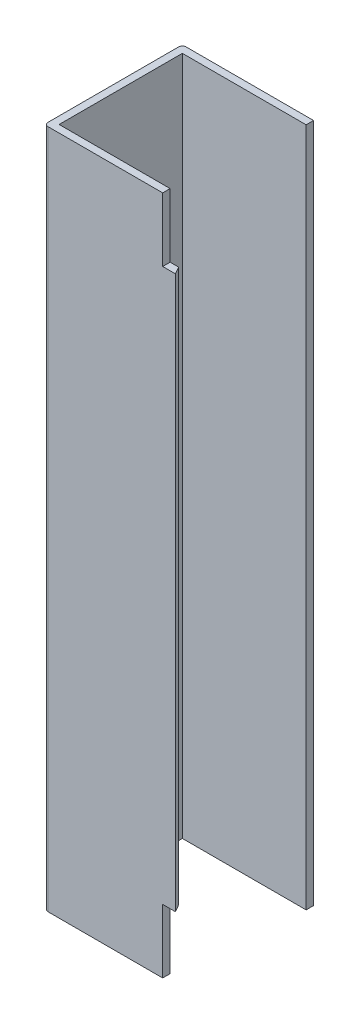
ISO-10303-21;
HEADER;
FILE_DESCRIPTION(('STEP AP214'),'2;1');
FILE_NAME('part.step','',(''),(''),'','','');
FILE_SCHEMA(('AUTOMOTIVE_DESIGN { 1 0 10303 214 1 1 1 1 }'));
ENDSEC;
DATA;
#1=APPLICATION_CONTEXT('core data for automotive mechanical design processes');
#2=APPLICATION_PROTOCOL_DEFINITION('international standard','automotive_design',2000,#1);
#3=PRODUCT_CONTEXT('',#1,'mechanical');
#4=PRODUCT('Part','Part','',(#3));
#5=PRODUCT_RELATED_PRODUCT_CATEGORY('part','',(#4));
#6=PRODUCT_DEFINITION_FORMATION('','',#4);
#7=PRODUCT_DEFINITION_CONTEXT('part definition',#1,'design');
#8=PRODUCT_DEFINITION('design','',#6,#7);
#9=PRODUCT_DEFINITION_SHAPE('','',#8);
#10=(LENGTH_UNIT() NAMED_UNIT(*) SI_UNIT(.MILLI.,.METRE.));
#11=(NAMED_UNIT(*) PLANE_ANGLE_UNIT() SI_UNIT($,.RADIAN.));
#12=(NAMED_UNIT(*) SI_UNIT($,.STERADIAN.) SOLID_ANGLE_UNIT());
#13=UNCERTAINTY_MEASURE_WITH_UNIT(LENGTH_MEASURE(1.E-05),#10,'distance_accuracy_value','');
#14=(GEOMETRIC_REPRESENTATION_CONTEXT(3) GLOBAL_UNCERTAINTY_ASSIGNED_CONTEXT((#13)) GLOBAL_UNIT_ASSIGNED_CONTEXT((#10,
#11,#12)) REPRESENTATION_CONTEXT('',''));
#15=CARTESIAN_POINT('',(0.,0.,0.));
#16=DIRECTION('',(0.,0.,1.));
#17=DIRECTION('',(1.,0.,0.));
#18=AXIS2_PLACEMENT_3D('',#15,#16,#17);
#19=CARTESIAN_POINT('',(-3.115,-1.6,0.0175));
#20=DIRECTION('',(1.,0.,0.));
#21=DIRECTION('',(0.,1.,0.));
#22=AXIS2_PLACEMENT_3D('',#19,#20,#21);
#23=PLANE('',#22);
#24=DIRECTION('',(0.,0.,1.));
#25=VECTOR('',#24,1.);
#26=CARTESIAN_POINT('',(-3.115,1.6,0.0175));
#27=LINE('',#26,#25);
#28=CARTESIAN_POINT('',(-3.115,1.6,0.0349999999999988));
#29=VERTEX_POINT('',#28);
#30=CARTESIAN_POINT('',(-3.115,1.6,0.615));
#31=VERTEX_POINT('',#30);
#32=EDGE_CURVE('E135',#29,#31,#27,.T.);
#33=ORIENTED_EDGE('',*,*,#32,.T.);
#34=DIRECTION('',(0.,1.,0.));
#35=VECTOR('',#34,1.);
#36=CARTESIAN_POINT('',(-3.115,0.,0.615));
#37=LINE('',#36,#35);
#38=CARTESIAN_POINT('',(-3.115,-1.6,0.614999999999999));
#39=VERTEX_POINT('',#38);
#40=EDGE_CURVE('E138',#39,#31,#37,.T.);
#41=ORIENTED_EDGE('',*,*,#40,.F.);
#42=DIRECTION('',(0.,0.,1.));
#43=VECTOR('',#42,1.);
#44=CARTESIAN_POINT('',(-3.115,-1.6,0.0175));
#45=LINE('',#44,#43);
#46=CARTESIAN_POINT('',(-3.115,-1.6,0.0349999999999995));
#47=VERTEX_POINT('',#46);
#48=EDGE_CURVE('E123',#39,#47,#45,.F.);
#49=ORIENTED_EDGE('',*,*,#48,.T.);
#50=DIRECTION('',(0.,1.,0.));
#51=VECTOR('',#50,1.);
#52=CARTESIAN_POINT('',(-3.115,-1.6,0.0349999999999993));
#53=LINE('',#52,#51);
#54=EDGE_CURVE('E148',#29,#47,#53,.F.);
#55=ORIENTED_EDGE('',*,*,#54,.F.);
#56=EDGE_LOOP('',(#33,#41,#49,#55));
#57=FACE_BOUND('',#56,.T.);
#58=ADVANCED_FACE('F17',(#57),#23,.T.);
#59=CARTESIAN_POINT('',(-2.5325,-1.6,0.035));
#60=DIRECTION('',(0.,0.,1.));
#61=DIRECTION('',(1.,0.,0.));
#62=AXIS2_PLACEMENT_3D('',#59,#60,#61);
#63=PLANE('',#62);
#64=DIRECTION('',(1.,0.,0.));
#65=VECTOR('',#64,1.);
#66=CARTESIAN_POINT('',(-2.5325,1.6,0.0349999999999989));
#67=LINE('',#66,#65);
#68=CARTESIAN_POINT('',(-2.5325,1.6,0.0349999999999996));
#69=VERTEX_POINT('',#68);
#70=EDGE_CURVE('E150',#69,#29,#67,.F.);
#71=ORIENTED_EDGE('',*,*,#70,.T.);
#72=ORIENTED_EDGE('',*,*,#54,.T.);
#73=DIRECTION('',(1.,0.,0.));
#74=VECTOR('',#73,1.);
#75=CARTESIAN_POINT('',(-2.5325,-1.6,0.035));
#76=LINE('',#75,#74);
#77=CARTESIAN_POINT('',(-2.5325,-1.6,0.035));
#78=VERTEX_POINT('',#77);
#79=EDGE_CURVE('E131',#47,#78,#76,.T.);
#80=ORIENTED_EDGE('',*,*,#79,.T.);
#81=DIRECTION('',(0.,-1.,0.));
#82=VECTOR('',#81,1.);
#83=CARTESIAN_POINT('',(-2.5325,0.,0.035));
#84=LINE('',#83,#82);
#85=EDGE_CURVE('E276',#78,#69,#84,.F.);
#86=ORIENTED_EDGE('',*,*,#85,.T.);
#87=EDGE_LOOP('',(#71,#72,#80,#86));
#88=FACE_BOUND('',#87,.T.);
#89=ADVANCED_FACE('F299',(#88),#63,.T.);
#90=CARTESIAN_POINT('',(-2.828508757436,0.,0.615));
#91=DIRECTION('',(0.,0.,-1.));
#92=DIRECTION('',(0.,1.,0.));
#93=AXIS2_PLACEMENT_3D('',#90,#91,#92);
#94=PLANE('',#93);
#95=DIRECTION('',(1.,0.,0.));
#96=VECTOR('',#95,1.);
#97=CARTESIAN_POINT('',(-2.5925,-1.3,0.615));
#98=LINE('',#97,#96);
#99=CARTESIAN_POINT('',(-2.5925,-1.3,0.615));
#100=VERTEX_POINT('',#99);
#101=CARTESIAN_POINT('',(-2.55270725942012,-1.3,0.615000000000071));
#102=VERTEX_POINT('',#101);
#103=EDGE_CURVE('E268',#100,#102,#98,.T.);
#104=ORIENTED_EDGE('',*,*,#103,.F.);
#105=DIRECTION('',(0.,1.,0.));
#106=VECTOR('',#105,1.);
#107=CARTESIAN_POINT('',(-2.5925,0.,0.615));
#108=LINE('',#107,#106);
#109=CARTESIAN_POINT('',(-2.5925,-1.6,0.615));
#110=VERTEX_POINT('',#109);
#111=EDGE_CURVE('E147',#100,#110,#108,.F.);
#112=ORIENTED_EDGE('',*,*,#111,.T.);
#113=DIRECTION('',(1.,0.,0.));
#114=VECTOR('',#113,1.);
#115=CARTESIAN_POINT('',(-2.828508757436,-1.6,0.614999999999999));
#116=LINE('',#115,#114);
#117=EDGE_CURVE('E128',#110,#39,#116,.F.);
#118=ORIENTED_EDGE('',*,*,#117,.T.);
#119=ORIENTED_EDGE('',*,*,#40,.T.);
#120=DIRECTION('',(1.,0.,0.));
#121=VECTOR('',#120,1.);
#122=CARTESIAN_POINT('',(-2.828508757436,1.6,0.615000000000001));
#123=LINE('',#122,#121);
#124=CARTESIAN_POINT('',(-2.5925,1.6,0.615));
#125=VERTEX_POINT('',#124);
#126=EDGE_CURVE('E142',#31,#125,#123,.T.);
#127=ORIENTED_EDGE('',*,*,#126,.T.);
#128=DIRECTION('',(0.,1.,0.));
#129=VECTOR('',#128,1.);
#130=CARTESIAN_POINT('',(-2.5925,0.,0.615));
#131=LINE('',#130,#129);
#132=CARTESIAN_POINT('',(-2.5925,1.3,0.615));
#133=VERTEX_POINT('',#132);
#134=EDGE_CURVE('E158',#125,#133,#131,.F.);
#135=ORIENTED_EDGE('',*,*,#134,.T.);
#136=DIRECTION('',(1.,0.,0.));
#137=VECTOR('',#136,1.);
#138=CARTESIAN_POINT('',(-2.828508757436,1.3,0.615000000000001));
#139=LINE('',#138,#137);
#140=CARTESIAN_POINT('',(-2.55270725942006,1.3,0.615000000000036));
#141=VERTEX_POINT('',#140);
#142=EDGE_CURVE('E161',#133,#141,#139,.T.);
#143=ORIENTED_EDGE('',*,*,#142,.T.);
#144=DIRECTION('',(0.,1.,0.));
#145=VECTOR('',#144,1.);
#146=CARTESIAN_POINT('',(-2.55270725942019,-1.3,0.615000000000107));
#147=LINE('',#146,#145);
#148=EDGE_CURVE('E258',#141,#102,#147,.F.);
#149=ORIENTED_EDGE('',*,*,#148,.T.);
#150=EDGE_LOOP('',(#104,#112,#118,#119,#127,#135,#143,#149));
#151=FACE_BOUND('',#150,.T.);
#152=ADVANCED_FACE('F146',(#151),#94,.T.);
#153=CARTESIAN_POINT('',(-2.5325,0.,0.0175));
#154=DIRECTION('',(-1.,0.,0.));
#155=DIRECTION('',(0.,-1.,0.));
#156=AXIS2_PLACEMENT_3D('',#153,#154,#155);
#157=PLANE('',#156);
#158=DIRECTION('',(0.,1.,0.));
#159=VECTOR('',#158,1.);
#160=CARTESIAN_POINT('',(-2.5325,1.6,0.));
#161=LINE('',#160,#159);
#162=CARTESIAN_POINT('',(-2.5325,1.6,0.));
#163=VERTEX_POINT('',#162);
#164=CARTESIAN_POINT('',(-2.5325,-1.6,0.));
#165=VERTEX_POINT('',#164);
#166=EDGE_CURVE('E223',#163,#165,#161,.F.);
#167=ORIENTED_EDGE('',*,*,#166,.F.);
#168=DIRECTION('',(0.,0.,1.));
#169=VECTOR('',#168,1.);
#170=CARTESIAN_POINT('',(-2.5325,1.6,0.0175));
#171=LINE('',#170,#169);
#172=EDGE_CURVE('E274',#69,#163,#171,.F.);
#173=ORIENTED_EDGE('',*,*,#172,.F.);
#174=ORIENTED_EDGE('',*,*,#85,.F.);
#175=DIRECTION('',(0.,0.,1.));
#176=VECTOR('',#175,1.);
#177=CARTESIAN_POINT('',(-2.5325,-1.6,0.0175));
#178=LINE('',#177,#176);
#179=EDGE_CURVE('E271',#165,#78,#178,.T.);
#180=ORIENTED_EDGE('',*,*,#179,.F.);
#181=EDGE_LOOP('',(#167,#173,#174,#180));
#182=FACE_BOUND('',#181,.T.);
#183=ADVANCED_FACE('F335',(#182),#157,.F.);
#184=CARTESIAN_POINT('',(-2.5925,-1.3,0.615));
#185=DIRECTION('',(0.,-1.,0.));
#186=DIRECTION('',(0.,0.,-1.));
#187=AXIS2_PLACEMENT_3D('',#184,#185,#186);
#188=PLANE('',#187);
#189=DIRECTION('',(0.499999999974195,0.,0.866025403799337));
#190=VECTOR('',#189,1.);
#191=CARTESIAN_POINT('',(-2.5325,-1.3,0.65));
#192=LINE('',#191,#190);
#193=CARTESIAN_POINT('',(-2.5325,-1.3,0.65));
#194=VERTEX_POINT('',#193);
#195=EDGE_CURVE('E250',#102,#194,#192,.T.);
#196=ORIENTED_EDGE('',*,*,#195,.T.);
#197=DIRECTION('',(1.,0.,0.));
#198=VECTOR('',#197,1.);
#199=CARTESIAN_POINT('',(-2.837236842105,-1.3,0.65));
#200=LINE('',#199,#198);
#201=CARTESIAN_POINT('',(-2.5925,-1.3,0.65));
#202=VERTEX_POINT('',#201);
#203=EDGE_CURVE('E215',#202,#194,#200,.T.);
#204=ORIENTED_EDGE('',*,*,#203,.F.);
#205=DIRECTION('',(0.,0.,1.));
#206=VECTOR('',#205,1.);
#207=CARTESIAN_POINT('',(-2.5925,-1.3,0.6325));
#208=LINE('',#207,#206);
#209=EDGE_CURVE('E216',#100,#202,#208,.T.);
#210=ORIENTED_EDGE('',*,*,#209,.F.);
#211=ORIENTED_EDGE('',*,*,#103,.T.);
#212=EDGE_LOOP('',(#196,#204,#210,#211));
#213=FACE_BOUND('',#212,.T.);
#214=ADVANCED_FACE('F317',(#213),#188,.T.);
#215=CARTESIAN_POINT('',(-2.5325,-1.3,0.65));
#216=DIRECTION('',(-0.866025403799337,0.,0.499999999974195));
#217=DIRECTION('',(0.499999999974195,0.,0.866025403799337));
#218=AXIS2_PLACEMENT_3D('',#215,#216,#217);
#219=PLANE('',#218);
#220=ORIENTED_EDGE('',*,*,#148,.F.);
#221=DIRECTION('',(-0.499999999969617,0.,-0.86602540380198));
#222=VECTOR('',#221,1.);
#223=CARTESIAN_POINT('',(-2.5325,1.3,0.65));
#224=LINE('',#223,#222);
#225=CARTESIAN_POINT('',(-2.5325,1.3,0.650000000000001));
#226=VERTEX_POINT('',#225);
#227=EDGE_CURVE('E241',#226,#141,#224,.T.);
#228=ORIENTED_EDGE('',*,*,#227,.F.);
#229=DIRECTION('',(0.,-1.,0.));
#230=VECTOR('',#229,1.);
#231=CARTESIAN_POINT('',(-2.5325,0.,0.65));
#232=LINE('',#231,#230);
#233=EDGE_CURVE('E245',#194,#226,#232,.F.);
#234=ORIENTED_EDGE('',*,*,#233,.F.);
#235=ORIENTED_EDGE('',*,*,#195,.F.);
#236=EDGE_LOOP('',(#220,#228,#234,#235));
#237=FACE_BOUND('',#236,.T.);
#238=ADVANCED_FACE('F313',(#237),#219,.F.);
#239=CARTESIAN_POINT('',(-2.5925,1.3,0.65));
#240=DIRECTION('',(0.,1.,0.));
#241=DIRECTION('',(0.,0.,1.));
#242=AXIS2_PLACEMENT_3D('',#239,#240,#241);
#243=PLANE('',#242);
#244=ORIENTED_EDGE('',*,*,#227,.T.);
#245=ORIENTED_EDGE('',*,*,#142,.F.);
#246=DIRECTION('',(0.,0.,1.));
#247=VECTOR('',#246,1.);
#248=CARTESIAN_POINT('',(-2.5925,1.3,0.6325));
#249=LINE('',#248,#247);
#250=CARTESIAN_POINT('',(-2.5925,1.3,0.650000000000001));
#251=VERTEX_POINT('',#250);
#252=EDGE_CURVE('E236',#251,#133,#249,.F.);
#253=ORIENTED_EDGE('',*,*,#252,.F.);
#254=DIRECTION('',(1.,0.,0.));
#255=VECTOR('',#254,1.);
#256=CARTESIAN_POINT('',(-2.837236842105,1.3,0.650000000000001));
#257=LINE('',#256,#255);
#258=EDGE_CURVE('E227',#226,#251,#257,.F.);
#259=ORIENTED_EDGE('',*,*,#258,.F.);
#260=EDGE_LOOP('',(#244,#245,#253,#259));
#261=FACE_BOUND('',#260,.T.);
#262=ADVANCED_FACE('F310',(#261),#243,.T.);
#263=CARTESIAN_POINT('',(-2.5925,0.,0.6325));
#264=DIRECTION('',(1.,0.,0.));
#265=DIRECTION('',(0.,1.,0.));
#266=AXIS2_PLACEMENT_3D('',#263,#264,#265);
#267=PLANE('',#266);
#268=DIRECTION('',(0.,0.,1.));
#269=VECTOR('',#268,1.);
#270=CARTESIAN_POINT('',(-2.5925,1.6,0.314647487115));
#271=LINE('',#270,#269);
#272=CARTESIAN_POINT('',(-2.5925,1.6,0.65));
#273=VERTEX_POINT('',#272);
#274=EDGE_CURVE('E202',#273,#125,#271,.F.);
#275=ORIENTED_EDGE('',*,*,#274,.F.);
#276=DIRECTION('',(0.,-1.,0.));
#277=VECTOR('',#276,1.);
#278=CARTESIAN_POINT('',(-2.5925,0.,0.65));
#279=LINE('',#278,#277);
#280=EDGE_CURVE('E66',#251,#273,#279,.F.);
#281=ORIENTED_EDGE('',*,*,#280,.F.);
#282=ORIENTED_EDGE('',*,*,#252,.T.);
#283=ORIENTED_EDGE('',*,*,#134,.F.);
#284=EDGE_LOOP('',(#275,#281,#282,#283));
#285=FACE_BOUND('',#284,.T.);
#286=ADVANCED_FACE('F307',(#285),#267,.T.);
#287=CARTESIAN_POINT('',(-2.5325,1.6,0.));
#288=DIRECTION('',(0.,0.,-1.));
#289=DIRECTION('',(-1.,0.,0.));
#290=AXIS2_PLACEMENT_3D('',#287,#288,#289);
#291=PLANE('',#290);
#292=DIRECTION('',(-1.,0.,0.));
#293=VECTOR('',#292,1.);
#294=CARTESIAN_POINT('',(-2.5325,-1.6,0.));
#295=LINE('',#294,#293);
#296=CARTESIAN_POINT('',(-3.1325,-1.6,0.));
#297=VERTEX_POINT('',#296);
#298=EDGE_CURVE('E221',#165,#297,#295,.T.);
#299=ORIENTED_EDGE('',*,*,#298,.T.);
#300=DIRECTION('',(0.,-1.,0.));
#301=VECTOR('',#300,1.);
#302=CARTESIAN_POINT('',(-3.1325,1.6,0.));
#303=LINE('',#302,#301);
#304=CARTESIAN_POINT('',(-3.1325,1.6,0.));
#305=VERTEX_POINT('',#304);
#306=EDGE_CURVE('E58',#297,#305,#303,.F.);
#307=ORIENTED_EDGE('',*,*,#306,.T.);
#308=DIRECTION('',(1.,0.,0.));
#309=VECTOR('',#308,1.);
#310=CARTESIAN_POINT('',(-2.938919337783,1.6,0.));
#311=LINE('',#310,#309);
#312=EDGE_CURVE('E203',#163,#305,#311,.F.);
#313=ORIENTED_EDGE('',*,*,#312,.F.);
#314=ORIENTED_EDGE('',*,*,#166,.T.);
#315=EDGE_LOOP('',(#299,#307,#313,#314));
#316=FACE_BOUND('',#315,.T.);
#317=ADVANCED_FACE('F333',(#316),#291,.T.);
#318=CARTESIAN_POINT('',(-2.5925,0.,0.6325));
#319=DIRECTION('',(1.,0.,0.));
#320=DIRECTION('',(0.,1.,0.));
#321=AXIS2_PLACEMENT_3D('',#318,#319,#320);
#322=PLANE('',#321);
#323=ORIENTED_EDGE('',*,*,#209,.T.);
#324=DIRECTION('',(0.,-1.,0.));
#325=VECTOR('',#324,1.);
#326=CARTESIAN_POINT('',(-2.5925,0.,0.65));
#327=LINE('',#326,#325);
#328=CARTESIAN_POINT('',(-2.5925,-1.6,0.65));
#329=VERTEX_POINT('',#328);
#330=EDGE_CURVE('E212',#329,#202,#327,.F.);
#331=ORIENTED_EDGE('',*,*,#330,.F.);
#332=DIRECTION('',(0.,0.,-1.));
#333=VECTOR('',#332,1.);
#334=CARTESIAN_POINT('',(-2.5925,-1.6,0.314647487115));
#335=LINE('',#334,#333);
#336=EDGE_CURVE('E185',#110,#329,#335,.F.);
#337=ORIENTED_EDGE('',*,*,#336,.F.);
#338=ORIENTED_EDGE('',*,*,#111,.F.);
#339=EDGE_LOOP('',(#323,#331,#337,#338));
#340=FACE_BOUND('',#339,.T.);
#341=ADVANCED_FACE('F320',(#340),#322,.T.);
#342=CARTESIAN_POINT('',(-2.837236842105,0.,0.65));
#343=DIRECTION('',(0.,0.,1.));
#344=DIRECTION('',(0.,-1.,0.));
#345=AXIS2_PLACEMENT_3D('',#342,#343,#344);
#346=PLANE('',#345);
#347=ORIENTED_EDGE('',*,*,#258,.T.);
#348=ORIENTED_EDGE('',*,*,#280,.T.);
#349=DIRECTION('',(1.,0.,0.));
#350=VECTOR('',#349,1.);
#351=CARTESIAN_POINT('',(-2.938919337783,1.6,0.65));
#352=LINE('',#351,#350);
#353=CARTESIAN_POINT('',(-3.1325,1.6,0.649999999999999));
#354=VERTEX_POINT('',#353);
#355=EDGE_CURVE('E199',#354,#273,#352,.T.);
#356=ORIENTED_EDGE('',*,*,#355,.F.);
#357=DIRECTION('',(0.,-1.,0.));
#358=VECTOR('',#357,1.);
#359=CARTESIAN_POINT('',(-3.1325,1.6,0.649999999999998));
#360=LINE('',#359,#358);
#361=CARTESIAN_POINT('',(-3.13250000000001,-1.6,0.649999999999999));
#362=VERTEX_POINT('',#361);
#363=EDGE_CURVE('E178',#354,#362,#360,.T.);
#364=ORIENTED_EDGE('',*,*,#363,.T.);
#365=DIRECTION('',(1.,0.,0.));
#366=VECTOR('',#365,1.);
#367=CARTESIAN_POINT('',(-2.938919337783,-1.6,0.65));
#368=LINE('',#367,#366);
#369=EDGE_CURVE('E183',#329,#362,#368,.F.);
#370=ORIENTED_EDGE('',*,*,#369,.F.);
#371=ORIENTED_EDGE('',*,*,#330,.T.);
#372=ORIENTED_EDGE('',*,*,#203,.T.);
#373=ORIENTED_EDGE('',*,*,#233,.T.);
#374=EDGE_LOOP('',(#347,#348,#356,#364,#370,#371,#372,#373));
#375=FACE_BOUND('',#374,.T.);
#376=ADVANCED_FACE('F321',(#375),#346,.T.);
#377=CARTESIAN_POINT('',(-2.938919337783,1.6,0.314647487115));
#378=DIRECTION('',(0.,1.,0.));
#379=DIRECTION('',(0.,0.,1.));
#380=AXIS2_PLACEMENT_3D('',#377,#378,#379);
#381=PLANE('',#380);
#382=ORIENTED_EDGE('',*,*,#126,.F.);
#383=ORIENTED_EDGE('',*,*,#32,.F.);
#384=ORIENTED_EDGE('',*,*,#70,.F.);
#385=ORIENTED_EDGE('',*,*,#172,.T.);
#386=ORIENTED_EDGE('',*,*,#312,.T.);
#387=CARTESIAN_POINT('',(-3.1325,1.6,0.0174999999999984));
#388=DIRECTION('',(0.,-1.,0.));
#389=DIRECTION('',(0.,0.,-1.));
#390=AXIS2_PLACEMENT_3D('',#387,#388,#389);
#391=CIRCLE('',#390,0.0174999999999986);
#392=CARTESIAN_POINT('',(-3.15,1.6,0.0174999999999992));
#393=VERTEX_POINT('',#392);
#394=EDGE_CURVE('E20',#305,#393,#391,.F.);
#395=ORIENTED_EDGE('',*,*,#394,.T.);
#396=DIRECTION('',(0.,0.,1.));
#397=VECTOR('',#396,1.);
#398=CARTESIAN_POINT('',(-3.15,1.6,0.0175));
#399=LINE('',#398,#397);
#400=CARTESIAN_POINT('',(-3.15,1.6,0.632499999999999));
#401=VERTEX_POINT('',#400);
#402=EDGE_CURVE('E177',#401,#393,#399,.F.);
#403=ORIENTED_EDGE('',*,*,#402,.F.);
#404=CARTESIAN_POINT('',(-3.1325,1.6,0.632499999999998));
#405=DIRECTION('',(0.,-1.,0.));
#406=DIRECTION('',(1.,0.,0.));
#407=AXIS2_PLACEMENT_3D('',#404,#405,#406);
#408=CIRCLE('',#407,0.0174999999999882);
#409=EDGE_CURVE('E179',#401,#354,#408,.F.);
#410=ORIENTED_EDGE('',*,*,#409,.T.);
#411=ORIENTED_EDGE('',*,*,#355,.T.);
#412=ORIENTED_EDGE('',*,*,#274,.T.);
#413=EDGE_LOOP('',(#382,#383,#384,#385,#386,#395,#403,#410,#411,#412));
#414=FACE_BOUND('',#413,.T.);
#415=ADVANCED_FACE('F303',(#414),#381,.T.);
#416=CARTESIAN_POINT('',(-3.1325,1.6,0.0174999999999984));
#417=DIRECTION('',(0.,-1.,0.));
#418=DIRECTION('',(0.,0.,-1.));
#419=AXIS2_PLACEMENT_3D('',#416,#417,#418);
#420=CYLINDRICAL_SURFACE('',#419,0.0174999999999986);
#421=DIRECTION('',(0.,-1.,0.));
#422=VECTOR('',#421,1.);
#423=CARTESIAN_POINT('',(-3.15,1.6,0.0175));
#424=LINE('',#423,#422);
#425=CARTESIAN_POINT('',(-3.15,-1.6,0.0174999999999992));
#426=VERTEX_POINT('',#425);
#427=EDGE_CURVE('E192',#393,#426,#424,.T.);
#428=ORIENTED_EDGE('',*,*,#427,.F.);
#429=ORIENTED_EDGE('',*,*,#394,.F.);
#430=ORIENTED_EDGE('',*,*,#306,.F.);
#431=CARTESIAN_POINT('',(-3.1325,-1.6,0.0174999999999984));
#432=DIRECTION('',(0.,-1.,0.));
#433=DIRECTION('',(0.,0.,-1.));
#434=AXIS2_PLACEMENT_3D('',#431,#432,#433);
#435=CIRCLE('',#434,0.0174999999999986);
#436=EDGE_CURVE('E181',#426,#297,#435,.T.);
#437=ORIENTED_EDGE('',*,*,#436,.F.);
#438=EDGE_LOOP('',(#428,#429,#430,#437));
#439=FACE_BOUND('',#438,.T.);
#440=ADVANCED_FACE('F331',(#439),#420,.T.);
#441=CARTESIAN_POINT('',(-2.938919337783,-1.6,0.314647487115));
#442=DIRECTION('',(0.,-1.,0.));
#443=DIRECTION('',(0.,0.,-1.));
#444=AXIS2_PLACEMENT_3D('',#441,#442,#443);
#445=PLANE('',#444);
#446=DIRECTION('',(0.,0.,1.));
#447=VECTOR('',#446,1.);
#448=CARTESIAN_POINT('',(-3.15,-1.6,0.0175));
#449=LINE('',#448,#447);
#450=CARTESIAN_POINT('',(-3.15,-1.6,0.632499999999999));
#451=VERTEX_POINT('',#450);
#452=EDGE_CURVE('E26',#426,#451,#449,.T.);
#453=ORIENTED_EDGE('',*,*,#452,.F.);
#454=ORIENTED_EDGE('',*,*,#436,.T.);
#455=ORIENTED_EDGE('',*,*,#298,.F.);
#456=ORIENTED_EDGE('',*,*,#179,.T.);
#457=ORIENTED_EDGE('',*,*,#79,.F.);
#458=ORIENTED_EDGE('',*,*,#48,.F.);
#459=ORIENTED_EDGE('',*,*,#117,.F.);
#460=ORIENTED_EDGE('',*,*,#336,.T.);
#461=ORIENTED_EDGE('',*,*,#369,.T.);
#462=CARTESIAN_POINT('',(-3.13250000000002,-1.6,0.632499999999998));
#463=DIRECTION('',(0.,-1.,0.));
#464=DIRECTION('',(1.,0.,0.));
#465=AXIS2_PLACEMENT_3D('',#462,#463,#464);
#466=CIRCLE('',#465,0.0174999999999882);
#467=EDGE_CURVE('E35',#362,#451,#466,.T.);
#468=ORIENTED_EDGE('',*,*,#467,.T.);
#469=EDGE_LOOP('',(#453,#454,#455,#456,#457,#458,#459,#460,#461,#468));
#470=FACE_BOUND('',#469,.T.);
#471=ADVANCED_FACE('F125',(#470),#445,.T.);
#472=CARTESIAN_POINT('',(-3.1325,1.6,0.632499999999998));
#473=DIRECTION('',(0.,-1.,0.));
#474=DIRECTION('',(1.,0.,0.));
#475=AXIS2_PLACEMENT_3D('',#472,#473,#474);
#476=CYLINDRICAL_SURFACE('',#475,0.0174999999999882);
#477=ORIENTED_EDGE('',*,*,#363,.F.);
#478=ORIENTED_EDGE('',*,*,#409,.F.);
#479=DIRECTION('',(0.,-1.,0.));
#480=VECTOR('',#479,1.);
#481=CARTESIAN_POINT('',(-3.15,1.6,0.6325));
#482=LINE('',#481,#480);
#483=EDGE_CURVE('E11',#451,#401,#482,.F.);
#484=ORIENTED_EDGE('',*,*,#483,.F.);
#485=ORIENTED_EDGE('',*,*,#467,.F.);
#486=EDGE_LOOP('',(#477,#478,#484,#485));
#487=FACE_BOUND('',#486,.T.);
#488=ADVANCED_FACE('F325',(#487),#476,.T.);
#489=CARTESIAN_POINT('',(-3.15,1.6,0.0175));
#490=DIRECTION('',(-1.,0.,0.));
#491=DIRECTION('',(0.,-1.,0.));
#492=AXIS2_PLACEMENT_3D('',#489,#490,#491);
#493=PLANE('',#492);
#494=ORIENTED_EDGE('',*,*,#452,.T.);
#495=ORIENTED_EDGE('',*,*,#483,.T.);
#496=ORIENTED_EDGE('',*,*,#402,.T.);
#497=ORIENTED_EDGE('',*,*,#427,.T.);
#498=EDGE_LOOP('',(#494,#495,#496,#497));
#499=FACE_BOUND('',#498,.T.);
#500=ADVANCED_FACE('F327',(#499),#493,.T.);
#501=CLOSED_SHELL('',(#58,#89,#152,#183,#214,#238,#262,#286,#317,#341,#376,#415,#440,#471,#488,#500));
#502=MANIFOLD_SOLID_BREP('B1',#501);
#503=ADVANCED_BREP_SHAPE_REPRESENTATION('',(#18,#502),#14);
#504=SHAPE_DEFINITION_REPRESENTATION(#9,#503);
ENDSEC;
END-ISO-10303-21;
